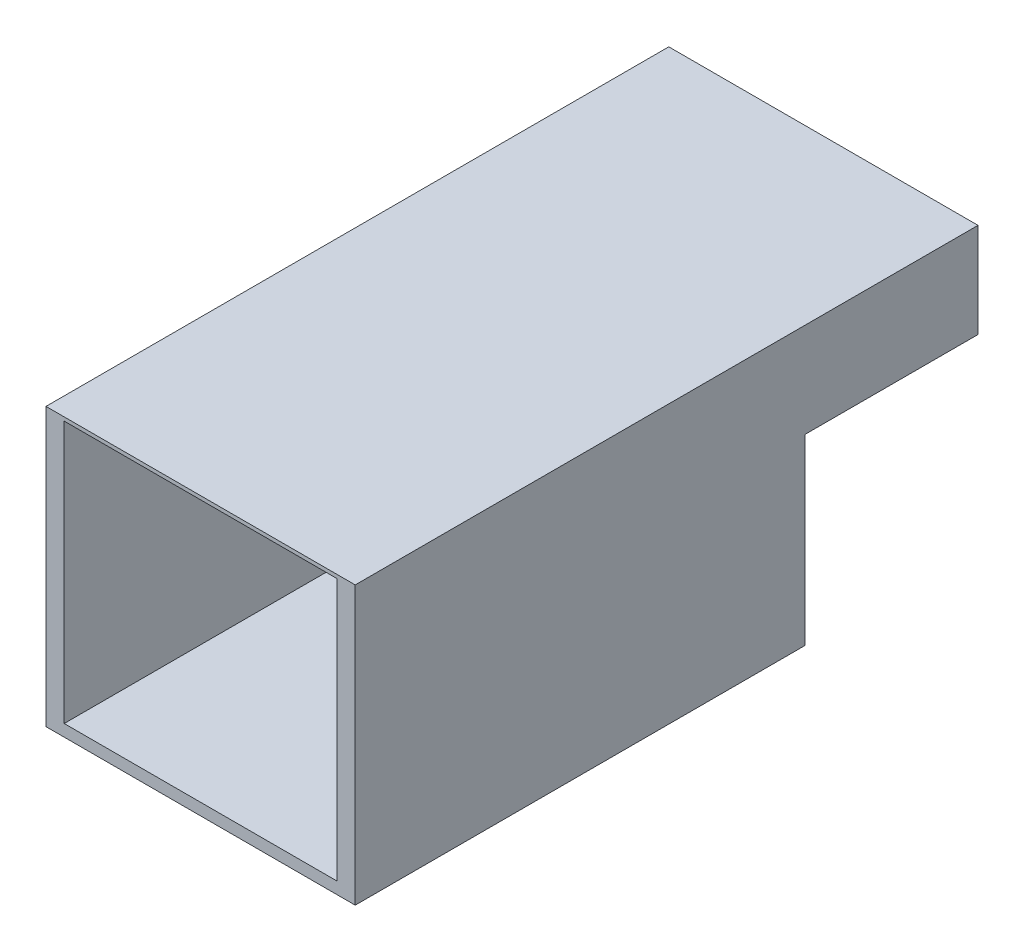
ISO-10303-21;
HEADER;
FILE_DESCRIPTION(('STEP AP214'),'2;1');
FILE_NAME('part.step','',(''),(''),'','','');
FILE_SCHEMA(('AUTOMOTIVE_DESIGN { 1 0 10303 214 1 1 1 1 }'));
ENDSEC;
DATA;
#1=APPLICATION_CONTEXT('core data for automotive mechanical design processes');
#2=APPLICATION_PROTOCOL_DEFINITION('international standard','automotive_design',2000,#1);
#3=PRODUCT_CONTEXT('',#1,'mechanical');
#4=PRODUCT('Part','Part','',(#3));
#5=PRODUCT_RELATED_PRODUCT_CATEGORY('part','',(#4));
#6=PRODUCT_DEFINITION_FORMATION('','',#4);
#7=PRODUCT_DEFINITION_CONTEXT('part definition',#1,'design');
#8=PRODUCT_DEFINITION('design','',#6,#7);
#9=PRODUCT_DEFINITION_SHAPE('','',#8);
#10=(LENGTH_UNIT() NAMED_UNIT(*) SI_UNIT(.MILLI.,.METRE.));
#11=(NAMED_UNIT(*) PLANE_ANGLE_UNIT() SI_UNIT($,.RADIAN.));
#12=(NAMED_UNIT(*) SI_UNIT($,.STERADIAN.) SOLID_ANGLE_UNIT());
#13=UNCERTAINTY_MEASURE_WITH_UNIT(LENGTH_MEASURE(1.E-05),#10,'distance_accuracy_value','');
#14=(GEOMETRIC_REPRESENTATION_CONTEXT(3) GLOBAL_UNCERTAINTY_ASSIGNED_CONTEXT((#13)) GLOBAL_UNIT_ASSIGNED_CONTEXT((#10,
#11,#12)) REPRESENTATION_CONTEXT('',''));
#15=CARTESIAN_POINT('',(0.,0.,0.));
#16=DIRECTION('',(0.,0.,1.));
#17=DIRECTION('',(1.,0.,0.));
#18=AXIS2_PLACEMENT_3D('',#15,#16,#17);
#19=CARTESIAN_POINT('',(431.8,0.,0.));
#20=DIRECTION('',(0.,0.,-1.));
#21=DIRECTION('',(-1.,0.,0.));
#22=AXIS2_PLACEMENT_3D('',#19,#20,#21);
#23=PLANE('',#22);
#24=DIRECTION('',(1.,0.,0.));
#25=VECTOR('',#24,1.);
#26=CARTESIAN_POINT('',(25.4,16.51,0.));
#27=LINE('',#26,#25);
#28=CARTESIAN_POINT('',(25.4,16.51,0.));
#29=VERTEX_POINT('',#28);
#30=CARTESIAN_POINT('',(406.4,16.51,0.));
#31=VERTEX_POINT('',#30);
#32=EDGE_CURVE('E162',#29,#31,#27,.T.);
#33=ORIENTED_EDGE('',*,*,#32,.F.);
#34=DIRECTION('',(0.,-1.,0.));
#35=VECTOR('',#34,1.);
#36=CARTESIAN_POINT('',(25.4,382.27,0.));
#37=LINE('',#36,#35);
#38=CARTESIAN_POINT('',(25.4,382.27,0.));
#39=VERTEX_POINT('',#38);
#40=EDGE_CURVE('E47',#39,#29,#37,.T.);
#41=ORIENTED_EDGE('',*,*,#40,.F.);
#42=DIRECTION('',(-1.,0.,0.));
#43=VECTOR('',#42,1.);
#44=CARTESIAN_POINT('',(25.4,382.27,0.));
#45=LINE('',#44,#43);
#46=CARTESIAN_POINT('',(406.4,382.27,0.));
#47=VERTEX_POINT('',#46);
#48=EDGE_CURVE('E153',#47,#39,#45,.T.);
#49=ORIENTED_EDGE('',*,*,#48,.F.);
#50=DIRECTION('',(0.,1.,0.));
#51=VECTOR('',#50,1.);
#52=CARTESIAN_POINT('',(406.4,382.27,0.));
#53=LINE('',#52,#51);
#54=EDGE_CURVE('E156',#31,#47,#53,.T.);
#55=ORIENTED_EDGE('',*,*,#54,.F.);
#56=EDGE_LOOP('',(#33,#41,#49,#55));
#57=FACE_BOUND('',#56,.T.);
#58=DIRECTION('',(0.,-1.,0.));
#59=VECTOR('',#58,1.);
#60=CARTESIAN_POINT('',(0.,0.,0.));
#61=LINE('',#60,#59);
#62=CARTESIAN_POINT('',(0.,387.35,0.));
#63=VERTEX_POINT('',#62);
#64=CARTESIAN_POINT('',(0.,0.,0.));
#65=VERTEX_POINT('',#64);
#66=EDGE_CURVE('E196',#63,#65,#61,.T.);
#67=ORIENTED_EDGE('',*,*,#66,.T.);
#68=DIRECTION('',(-1.,0.,0.));
#69=VECTOR('',#68,1.);
#70=CARTESIAN_POINT('',(431.8,0.,0.));
#71=LINE('',#70,#69);
#72=CARTESIAN_POINT('',(431.8,0.,0.));
#73=VERTEX_POINT('',#72);
#74=EDGE_CURVE('E11',#73,#65,#71,.T.);
#75=ORIENTED_EDGE('',*,*,#74,.F.);
#76=DIRECTION('',(0.,-1.,0.));
#77=VECTOR('',#76,1.);
#78=CARTESIAN_POINT('',(431.8,0.,0.));
#79=LINE('',#78,#77);
#80=CARTESIAN_POINT('',(431.8,387.35,0.));
#81=VERTEX_POINT('',#80);
#82=EDGE_CURVE('E202',#81,#73,#79,.T.);
#83=ORIENTED_EDGE('',*,*,#82,.F.);
#84=DIRECTION('',(-1.,0.,0.));
#85=VECTOR('',#84,1.);
#86=CARTESIAN_POINT('',(431.8,387.35,0.));
#87=LINE('',#86,#85);
#88=EDGE_CURVE('E216',#81,#63,#87,.T.);
#89=ORIENTED_EDGE('',*,*,#88,.T.);
#90=EDGE_LOOP('',(#67,#75,#83,#89));
#91=FACE_BOUND('',#90,.T.);
#92=ADVANCED_FACE('F33',(#57,#91),#23,.F.);
#93=CARTESIAN_POINT('',(431.8,0.,-628.396));
#94=DIRECTION('',(0.,1.,0.));
#95=DIRECTION('',(0.,0.,1.));
#96=AXIS2_PLACEMENT_3D('',#93,#94,#95);
#97=PLANE('',#96);
#98=DIRECTION('',(0.,0.,-1.));
#99=VECTOR('',#98,1.);
#100=CARTESIAN_POINT('',(0.,0.,-628.396));
#101=LINE('',#100,#99);
#102=CARTESIAN_POINT('',(0.,0.,-628.396));
#103=VERTEX_POINT('',#102);
#104=EDGE_CURVE('E219',#65,#103,#101,.T.);
#105=ORIENTED_EDGE('',*,*,#104,.T.);
#106=DIRECTION('',(-1.,0.,0.));
#107=VECTOR('',#106,1.);
#108=CARTESIAN_POINT('',(431.8,0.,-628.396));
#109=LINE('',#108,#107);
#110=CARTESIAN_POINT('',(431.8,0.,-628.396));
#111=VERTEX_POINT('',#110);
#112=EDGE_CURVE('E40',#111,#103,#109,.T.);
#113=ORIENTED_EDGE('',*,*,#112,.F.);
#114=DIRECTION('',(0.,0.,-1.));
#115=VECTOR('',#114,1.);
#116=CARTESIAN_POINT('',(431.8,0.,0.));
#117=LINE('',#116,#115);
#118=EDGE_CURVE('E205',#73,#111,#117,.T.);
#119=ORIENTED_EDGE('',*,*,#118,.F.);
#120=ORIENTED_EDGE('',*,*,#74,.T.);
#121=EDGE_LOOP('',(#105,#113,#119,#120));
#122=FACE_BOUND('',#121,.T.);
#123=ADVANCED_FACE('F266',(#122),#97,.F.);
#124=CARTESIAN_POINT('',(431.8,255.27,-628.396));
#125=DIRECTION('',(0.,0.,1.));
#126=DIRECTION('',(1.,0.,0.));
#127=AXIS2_PLACEMENT_3D('',#124,#125,#126);
#128=PLANE('',#127);
#129=DIRECTION('',(-1.,0.,0.));
#130=VECTOR('',#129,1.);
#131=CARTESIAN_POINT('',(406.4,16.51,-628.396));
#132=LINE('',#131,#130);
#133=CARTESIAN_POINT('',(406.4,16.51,-628.396));
#134=VERTEX_POINT('',#133);
#135=CARTESIAN_POINT('',(25.4,16.51,-628.396));
#136=VERTEX_POINT('',#135);
#137=EDGE_CURVE('E186',#134,#136,#132,.T.);
#138=ORIENTED_EDGE('',*,*,#137,.F.);
#139=DIRECTION('',(0.,-1.,0.));
#140=VECTOR('',#139,1.);
#141=CARTESIAN_POINT('',(406.4,247.65,-628.396));
#142=LINE('',#141,#140);
#143=CARTESIAN_POINT('',(406.4,247.65,-628.396));
#144=VERTEX_POINT('',#143);
#145=EDGE_CURVE('E55',#144,#134,#142,.T.);
#146=ORIENTED_EDGE('',*,*,#145,.F.);
#147=DIRECTION('',(1.,0.,0.));
#148=VECTOR('',#147,1.);
#149=CARTESIAN_POINT('',(406.4,247.65,-628.396));
#150=LINE('',#149,#148);
#151=CARTESIAN_POINT('',(25.4,247.65,-628.396));
#152=VERTEX_POINT('',#151);
#153=EDGE_CURVE('E175',#152,#144,#150,.T.);
#154=ORIENTED_EDGE('',*,*,#153,.F.);
#155=DIRECTION('',(0.,1.,0.));
#156=VECTOR('',#155,1.);
#157=CARTESIAN_POINT('',(25.4,247.65,-628.396));
#158=LINE('',#157,#156);
#159=EDGE_CURVE('E189',#136,#152,#158,.T.);
#160=ORIENTED_EDGE('',*,*,#159,.F.);
#161=EDGE_LOOP('',(#138,#146,#154,#160));
#162=FACE_BOUND('',#161,.T.);
#163=DIRECTION('',(0.,1.,0.));
#164=VECTOR('',#163,1.);
#165=CARTESIAN_POINT('',(0.,255.27,-628.396));
#166=LINE('',#165,#164);
#167=CARTESIAN_POINT('',(0.,255.27,-628.396));
#168=VERTEX_POINT('',#167);
#169=EDGE_CURVE('E221',#103,#168,#166,.T.);
#170=ORIENTED_EDGE('',*,*,#169,.T.);
#171=DIRECTION('',(-1.,0.,0.));
#172=VECTOR('',#171,1.);
#173=CARTESIAN_POINT('',(431.8,255.27,-628.396));
#174=LINE('',#173,#172);
#175=CARTESIAN_POINT('',(431.8,255.27,-628.396));
#176=VERTEX_POINT('',#175);
#177=EDGE_CURVE('E237',#176,#168,#174,.T.);
#178=ORIENTED_EDGE('',*,*,#177,.F.);
#179=DIRECTION('',(0.,1.,0.));
#180=VECTOR('',#179,1.);
#181=CARTESIAN_POINT('',(431.8,255.27,-628.396));
#182=LINE('',#181,#180);
#183=EDGE_CURVE('E208',#111,#176,#182,.T.);
#184=ORIENTED_EDGE('',*,*,#183,.F.);
#185=ORIENTED_EDGE('',*,*,#112,.T.);
#186=EDGE_LOOP('',(#170,#178,#184,#185));
#187=FACE_BOUND('',#186,.T.);
#188=ADVANCED_FACE('F244',(#162,#187),#128,.F.);
#189=CARTESIAN_POINT('',(431.8,255.27,-869.696));
#190=DIRECTION('',(0.,1.,0.));
#191=DIRECTION('',(0.,0.,1.));
#192=AXIS2_PLACEMENT_3D('',#189,#190,#191);
#193=PLANE('',#192);
#194=DIRECTION('',(0.,0.,-1.));
#195=VECTOR('',#194,1.);
#196=CARTESIAN_POINT('',(0.,255.27,-869.696));
#197=LINE('',#196,#195);
#198=CARTESIAN_POINT('',(0.,255.27,-869.696));
#199=VERTEX_POINT('',#198);
#200=EDGE_CURVE('E223',#168,#199,#197,.T.);
#201=ORIENTED_EDGE('',*,*,#200,.T.);
#202=DIRECTION('',(-1.,0.,0.));
#203=VECTOR('',#202,1.);
#204=CARTESIAN_POINT('',(431.8,255.27,-869.696));
#205=LINE('',#204,#203);
#206=CARTESIAN_POINT('',(431.8,255.27,-869.696));
#207=VERTEX_POINT('',#206);
#208=EDGE_CURVE('E234',#207,#199,#205,.T.);
#209=ORIENTED_EDGE('',*,*,#208,.F.);
#210=DIRECTION('',(0.,0.,-1.));
#211=VECTOR('',#210,1.);
#212=CARTESIAN_POINT('',(431.8,255.27,-869.696));
#213=LINE('',#212,#211);
#214=EDGE_CURVE('E210',#176,#207,#213,.T.);
#215=ORIENTED_EDGE('',*,*,#214,.F.);
#216=ORIENTED_EDGE('',*,*,#177,.T.);
#217=EDGE_LOOP('',(#201,#209,#215,#216));
#218=FACE_BOUND('',#217,.T.);
#219=ADVANCED_FACE('F254',(#218),#193,.F.);
#220=CARTESIAN_POINT('',(431.8,387.35,-869.696));
#221=DIRECTION('',(0.,0.,1.));
#222=DIRECTION('',(1.,0.,0.));
#223=AXIS2_PLACEMENT_3D('',#220,#221,#222);
#224=PLANE('',#223);
#225=DIRECTION('',(0.,1.,0.));
#226=VECTOR('',#225,1.);
#227=CARTESIAN_POINT('',(0.,387.35,-869.696));
#228=LINE('',#227,#226);
#229=CARTESIAN_POINT('',(0.,387.35,-869.696));
#230=VERTEX_POINT('',#229);
#231=EDGE_CURVE('E225',#199,#230,#228,.T.);
#232=ORIENTED_EDGE('',*,*,#231,.T.);
#233=DIRECTION('',(-1.,0.,0.));
#234=VECTOR('',#233,1.);
#235=CARTESIAN_POINT('',(431.8,387.35,-869.696));
#236=LINE('',#235,#234);
#237=CARTESIAN_POINT('',(431.8,387.35,-869.696));
#238=VERTEX_POINT('',#237);
#239=EDGE_CURVE('E231',#238,#230,#236,.T.);
#240=ORIENTED_EDGE('',*,*,#239,.F.);
#241=DIRECTION('',(0.,1.,0.));
#242=VECTOR('',#241,1.);
#243=CARTESIAN_POINT('',(431.8,387.35,-869.696));
#244=LINE('',#243,#242);
#245=EDGE_CURVE('E212',#207,#238,#244,.T.);
#246=ORIENTED_EDGE('',*,*,#245,.F.);
#247=ORIENTED_EDGE('',*,*,#208,.T.);
#248=EDGE_LOOP('',(#232,#240,#246,#247));
#249=FACE_BOUND('',#248,.T.);
#250=ADVANCED_FACE('F258',(#249),#224,.F.);
#251=CARTESIAN_POINT('',(431.8,387.35,0.));
#252=DIRECTION('',(0.,-1.,0.));
#253=DIRECTION('',(0.,0.,-1.));
#254=AXIS2_PLACEMENT_3D('',#251,#252,#253);
#255=PLANE('',#254);
#256=DIRECTION('',(0.,0.,1.));
#257=VECTOR('',#256,1.);
#258=CARTESIAN_POINT('',(0.,387.35,0.));
#259=LINE('',#258,#257);
#260=EDGE_CURVE('E206',#230,#63,#259,.T.);
#261=ORIENTED_EDGE('',*,*,#260,.T.);
#262=ORIENTED_EDGE('',*,*,#88,.F.);
#263=DIRECTION('',(0.,0.,1.));
#264=VECTOR('',#263,1.);
#265=CARTESIAN_POINT('',(431.8,387.35,-412.496));
#266=LINE('',#265,#264);
#267=EDGE_CURVE('E214',#238,#81,#266,.T.);
#268=ORIENTED_EDGE('',*,*,#267,.F.);
#269=ORIENTED_EDGE('',*,*,#239,.T.);
#270=EDGE_LOOP('',(#261,#262,#268,#269));
#271=FACE_BOUND('',#270,.T.);
#272=ADVANCED_FACE('F269',(#271),#255,.F.);
#273=CARTESIAN_POINT('',(431.8,0.,0.));
#274=DIRECTION('',(-1.,0.,0.));
#275=DIRECTION('',(0.,0.,1.));
#276=AXIS2_PLACEMENT_3D('',#273,#274,#275);
#277=PLANE('',#276);
#278=ORIENTED_EDGE('',*,*,#82,.T.);
#279=ORIENTED_EDGE('',*,*,#118,.T.);
#280=ORIENTED_EDGE('',*,*,#183,.T.);
#281=ORIENTED_EDGE('',*,*,#214,.T.);
#282=ORIENTED_EDGE('',*,*,#245,.T.);
#283=ORIENTED_EDGE('',*,*,#267,.T.);
#284=EDGE_LOOP('',(#278,#279,#280,#281,#282,#283));
#285=FACE_BOUND('',#284,.T.);
#286=ADVANCED_FACE('F262',(#285),#277,.F.);
#287=CARTESIAN_POINT('',(0.,0.,0.));
#288=DIRECTION('',(-1.,0.,0.));
#289=DIRECTION('',(0.,0.,1.));
#290=AXIS2_PLACEMENT_3D('',#287,#288,#289);
#291=PLANE('',#290);
#292=ORIENTED_EDGE('',*,*,#66,.F.);
#293=ORIENTED_EDGE('',*,*,#260,.F.);
#294=ORIENTED_EDGE('',*,*,#231,.F.);
#295=ORIENTED_EDGE('',*,*,#200,.F.);
#296=ORIENTED_EDGE('',*,*,#169,.F.);
#297=ORIENTED_EDGE('',*,*,#104,.F.);
#298=EDGE_LOOP('',(#292,#293,#294,#295,#296,#297));
#299=FACE_BOUND('',#298,.T.);
#300=ADVANCED_FACE('F250',(#299),#291,.T.);
#301=CARTESIAN_POINT('',(406.4,247.65,-425.196));
#302=DIRECTION('',(1.,0.,0.));
#303=DIRECTION('',(0.,1.,0.));
#304=AXIS2_PLACEMENT_3D('',#301,#302,#303);
#305=PLANE('',#304);
#306=ORIENTED_EDGE('',*,*,#145,.T.);
#307=DIRECTION('',(0.,0.,-1.));
#308=VECTOR('',#307,1.);
#309=CARTESIAN_POINT('',(406.4,16.51,-425.196));
#310=LINE('',#309,#308);
#311=CARTESIAN_POINT('',(406.4,16.51,-425.196));
#312=VERTEX_POINT('',#311);
#313=EDGE_CURVE('E184',#312,#134,#310,.T.);
#314=ORIENTED_EDGE('',*,*,#313,.F.);
#315=DIRECTION('',(0.,-1.,0.));
#316=VECTOR('',#315,1.);
#317=CARTESIAN_POINT('',(406.4,247.65,-425.196));
#318=LINE('',#317,#316);
#319=CARTESIAN_POINT('',(406.4,247.65,-425.196));
#320=VERTEX_POINT('',#319);
#321=EDGE_CURVE('E171',#320,#312,#318,.T.);
#322=ORIENTED_EDGE('',*,*,#321,.F.);
#323=DIRECTION('',(0.,0.,-1.));
#324=VECTOR('',#323,1.);
#325=CARTESIAN_POINT('',(406.4,247.65,-425.196));
#326=LINE('',#325,#324);
#327=EDGE_CURVE('E194',#320,#144,#326,.T.);
#328=ORIENTED_EDGE('',*,*,#327,.T.);
#329=EDGE_LOOP('',(#306,#314,#322,#328));
#330=FACE_BOUND('',#329,.T.);
#331=ADVANCED_FACE('F311',(#330),#305,.F.);
#332=CARTESIAN_POINT('',(406.4,247.65,-425.196));
#333=DIRECTION('',(0.,1.,0.));
#334=DIRECTION('',(0.,0.,1.));
#335=AXIS2_PLACEMENT_3D('',#332,#333,#334);
#336=PLANE('',#335);
#337=ORIENTED_EDGE('',*,*,#153,.T.);
#338=ORIENTED_EDGE('',*,*,#327,.F.);
#339=DIRECTION('',(1.,0.,0.));
#340=VECTOR('',#339,1.);
#341=CARTESIAN_POINT('',(406.4,247.65,-425.196));
#342=LINE('',#341,#340);
#343=CARTESIAN_POINT('',(25.4,247.65,-425.196));
#344=VERTEX_POINT('',#343);
#345=EDGE_CURVE('E181',#344,#320,#342,.T.);
#346=ORIENTED_EDGE('',*,*,#345,.F.);
#347=DIRECTION('',(0.,0.,-1.));
#348=VECTOR('',#347,1.);
#349=CARTESIAN_POINT('',(25.4,247.65,-425.196));
#350=LINE('',#349,#348);
#351=EDGE_CURVE('E197',#344,#152,#350,.T.);
#352=ORIENTED_EDGE('',*,*,#351,.T.);
#353=EDGE_LOOP('',(#337,#338,#346,#352));
#354=FACE_BOUND('',#353,.T.);
#355=ADVANCED_FACE('F307',(#354),#336,.F.);
#356=CARTESIAN_POINT('',(25.4,247.65,-425.196));
#357=DIRECTION('',(-1.,0.,0.));
#358=DIRECTION('',(0.,-1.,0.));
#359=AXIS2_PLACEMENT_3D('',#356,#357,#358);
#360=PLANE('',#359);
#361=ORIENTED_EDGE('',*,*,#159,.T.);
#362=ORIENTED_EDGE('',*,*,#351,.F.);
#363=DIRECTION('',(0.,1.,0.));
#364=VECTOR('',#363,1.);
#365=CARTESIAN_POINT('',(25.4,247.65,-425.196));
#366=LINE('',#365,#364);
#367=CARTESIAN_POINT('',(25.4,16.51,-425.196));
#368=VERTEX_POINT('',#367);
#369=EDGE_CURVE('E178',#368,#344,#366,.T.);
#370=ORIENTED_EDGE('',*,*,#369,.F.);
#371=DIRECTION('',(0.,0.,-1.));
#372=VECTOR('',#371,1.);
#373=CARTESIAN_POINT('',(25.4,16.51,-425.196));
#374=LINE('',#373,#372);
#375=EDGE_CURVE('E199',#368,#136,#374,.T.);
#376=ORIENTED_EDGE('',*,*,#375,.T.);
#377=EDGE_LOOP('',(#361,#362,#370,#376));
#378=FACE_BOUND('',#377,.T.);
#379=ADVANCED_FACE('F310',(#378),#360,.F.);
#380=CARTESIAN_POINT('',(406.4,16.51,-425.196));
#381=DIRECTION('',(0.,-1.,0.));
#382=DIRECTION('',(0.,0.,-1.));
#383=AXIS2_PLACEMENT_3D('',#380,#381,#382);
#384=PLANE('',#383);
#385=ORIENTED_EDGE('',*,*,#137,.T.);
#386=ORIENTED_EDGE('',*,*,#375,.F.);
#387=DIRECTION('',(-1.,0.,0.));
#388=VECTOR('',#387,1.);
#389=CARTESIAN_POINT('',(406.4,16.51,-425.196));
#390=LINE('',#389,#388);
#391=EDGE_CURVE('E174',#312,#368,#390,.T.);
#392=ORIENTED_EDGE('',*,*,#391,.F.);
#393=ORIENTED_EDGE('',*,*,#313,.T.);
#394=EDGE_LOOP('',(#385,#386,#392,#393));
#395=FACE_BOUND('',#394,.T.);
#396=ADVANCED_FACE('F305',(#395),#384,.F.);
#397=CARTESIAN_POINT('',(0.,0.,-425.196));
#398=DIRECTION('',(0.,0.,-1.));
#399=DIRECTION('',(-1.,0.,0.));
#400=AXIS2_PLACEMENT_3D('',#397,#398,#399);
#401=PLANE('',#400);
#402=ORIENTED_EDGE('',*,*,#321,.T.);
#403=ORIENTED_EDGE('',*,*,#391,.T.);
#404=ORIENTED_EDGE('',*,*,#369,.T.);
#405=ORIENTED_EDGE('',*,*,#345,.T.);
#406=EDGE_LOOP('',(#402,#403,#404,#405));
#407=FACE_BOUND('',#406,.T.);
#408=ADVANCED_FACE('F297',(#407),#401,.T.);
#409=CARTESIAN_POINT('',(25.4,382.27,-412.496));
#410=DIRECTION('',(-1.,0.,0.));
#411=DIRECTION('',(0.,-1.,0.));
#412=AXIS2_PLACEMENT_3D('',#409,#410,#411);
#413=PLANE('',#412);
#414=ORIENTED_EDGE('',*,*,#40,.T.);
#415=DIRECTION('',(0.,0.,1.));
#416=VECTOR('',#415,1.);
#417=CARTESIAN_POINT('',(25.4,16.51,-412.496));
#418=LINE('',#417,#416);
#419=CARTESIAN_POINT('',(25.4,16.51,-412.496));
#420=VERTEX_POINT('',#419);
#421=EDGE_CURVE('E131',#420,#29,#418,.T.);
#422=ORIENTED_EDGE('',*,*,#421,.F.);
#423=DIRECTION('',(0.,-1.,0.));
#424=VECTOR('',#423,1.);
#425=CARTESIAN_POINT('',(25.4,382.27,-412.496));
#426=LINE('',#425,#424);
#427=CARTESIAN_POINT('',(25.4,382.27,-412.496));
#428=VERTEX_POINT('',#427);
#429=EDGE_CURVE('E135',#428,#420,#426,.T.);
#430=ORIENTED_EDGE('',*,*,#429,.F.);
#431=DIRECTION('',(0.,0.,1.));
#432=VECTOR('',#431,1.);
#433=CARTESIAN_POINT('',(25.4,382.27,-412.496));
#434=LINE('',#433,#432);
#435=EDGE_CURVE('E166',#428,#39,#434,.T.);
#436=ORIENTED_EDGE('',*,*,#435,.T.);
#437=EDGE_LOOP('',(#414,#422,#430,#436));
#438=FACE_BOUND('',#437,.T.);
#439=ADVANCED_FACE('F133',(#438),#413,.F.);
#440=CARTESIAN_POINT('',(25.4,382.27,-412.496));
#441=DIRECTION('',(0.,1.,0.));
#442=DIRECTION('',(0.,0.,1.));
#443=AXIS2_PLACEMENT_3D('',#440,#441,#442);
#444=PLANE('',#443);
#445=ORIENTED_EDGE('',*,*,#48,.T.);
#446=ORIENTED_EDGE('',*,*,#435,.F.);
#447=DIRECTION('',(-1.,0.,0.));
#448=VECTOR('',#447,1.);
#449=CARTESIAN_POINT('',(25.4,382.27,-412.496));
#450=LINE('',#449,#448);
#451=CARTESIAN_POINT('',(406.4,382.27,-412.496));
#452=VERTEX_POINT('',#451);
#453=EDGE_CURVE('E141',#452,#428,#450,.T.);
#454=ORIENTED_EDGE('',*,*,#453,.F.);
#455=DIRECTION('',(0.,0.,1.));
#456=VECTOR('',#455,1.);
#457=CARTESIAN_POINT('',(406.4,382.27,-412.496));
#458=LINE('',#457,#456);
#459=EDGE_CURVE('E168',#452,#47,#458,.T.);
#460=ORIENTED_EDGE('',*,*,#459,.T.);
#461=EDGE_LOOP('',(#445,#446,#454,#460));
#462=FACE_BOUND('',#461,.T.);
#463=ADVANCED_FACE('F289',(#462),#444,.F.);
#464=CARTESIAN_POINT('',(406.4,382.27,-412.496));
#465=DIRECTION('',(1.,0.,0.));
#466=DIRECTION('',(0.,1.,0.));
#467=AXIS2_PLACEMENT_3D('',#464,#465,#466);
#468=PLANE('',#467);
#469=ORIENTED_EDGE('',*,*,#54,.T.);
#470=ORIENTED_EDGE('',*,*,#459,.F.);
#471=DIRECTION('',(0.,1.,0.));
#472=VECTOR('',#471,1.);
#473=CARTESIAN_POINT('',(406.4,382.27,-412.496));
#474=LINE('',#473,#472);
#475=CARTESIAN_POINT('',(406.4,16.51,-412.496));
#476=VERTEX_POINT('',#475);
#477=EDGE_CURVE('E149',#476,#452,#474,.T.);
#478=ORIENTED_EDGE('',*,*,#477,.F.);
#479=DIRECTION('',(0.,0.,1.));
#480=VECTOR('',#479,1.);
#481=CARTESIAN_POINT('',(406.4,16.51,-412.496));
#482=LINE('',#481,#480);
#483=EDGE_CURVE('E140',#476,#31,#482,.T.);
#484=ORIENTED_EDGE('',*,*,#483,.T.);
#485=EDGE_LOOP('',(#469,#470,#478,#484));
#486=FACE_BOUND('',#485,.T.);
#487=ADVANCED_FACE('F287',(#486),#468,.F.);
#488=CARTESIAN_POINT('',(25.4,16.51,-412.496));
#489=DIRECTION('',(0.,-1.,0.));
#490=DIRECTION('',(0.,0.,-1.));
#491=AXIS2_PLACEMENT_3D('',#488,#489,#490);
#492=PLANE('',#491);
#493=ORIENTED_EDGE('',*,*,#32,.T.);
#494=ORIENTED_EDGE('',*,*,#483,.F.);
#495=DIRECTION('',(1.,0.,0.));
#496=VECTOR('',#495,1.);
#497=CARTESIAN_POINT('',(25.4,16.51,-412.496));
#498=LINE('',#497,#496);
#499=EDGE_CURVE('E144',#420,#476,#498,.T.);
#500=ORIENTED_EDGE('',*,*,#499,.F.);
#501=ORIENTED_EDGE('',*,*,#421,.T.);
#502=EDGE_LOOP('',(#493,#494,#500,#501));
#503=FACE_BOUND('',#502,.T.);
#504=ADVANCED_FACE('F145',(#503),#492,.F.);
#505=CARTESIAN_POINT('',(0.,0.,-412.496));
#506=DIRECTION('',(0.,0.,1.));
#507=DIRECTION('',(1.,0.,0.));
#508=AXIS2_PLACEMENT_3D('',#505,#506,#507);
#509=PLANE('',#508);
#510=ORIENTED_EDGE('',*,*,#429,.T.);
#511=ORIENTED_EDGE('',*,*,#499,.T.);
#512=ORIENTED_EDGE('',*,*,#477,.T.);
#513=ORIENTED_EDGE('',*,*,#453,.T.);
#514=EDGE_LOOP('',(#510,#511,#512,#513));
#515=FACE_BOUND('',#514,.T.);
#516=ADVANCED_FACE('F151',(#515),#509,.T.);
#517=CLOSED_SHELL('',(#92,#123,#188,#219,#250,#272,#286,#300,#331,#355,#379,#396,#408,#439,#463,
#487,#504,#516));
#518=MANIFOLD_SOLID_BREP('B2',#517);
#519=ADVANCED_BREP_SHAPE_REPRESENTATION('',(#18,#518),#14);
#520=SHAPE_DEFINITION_REPRESENTATION(#9,#519);
ENDSEC;
END-ISO-10303-21;
